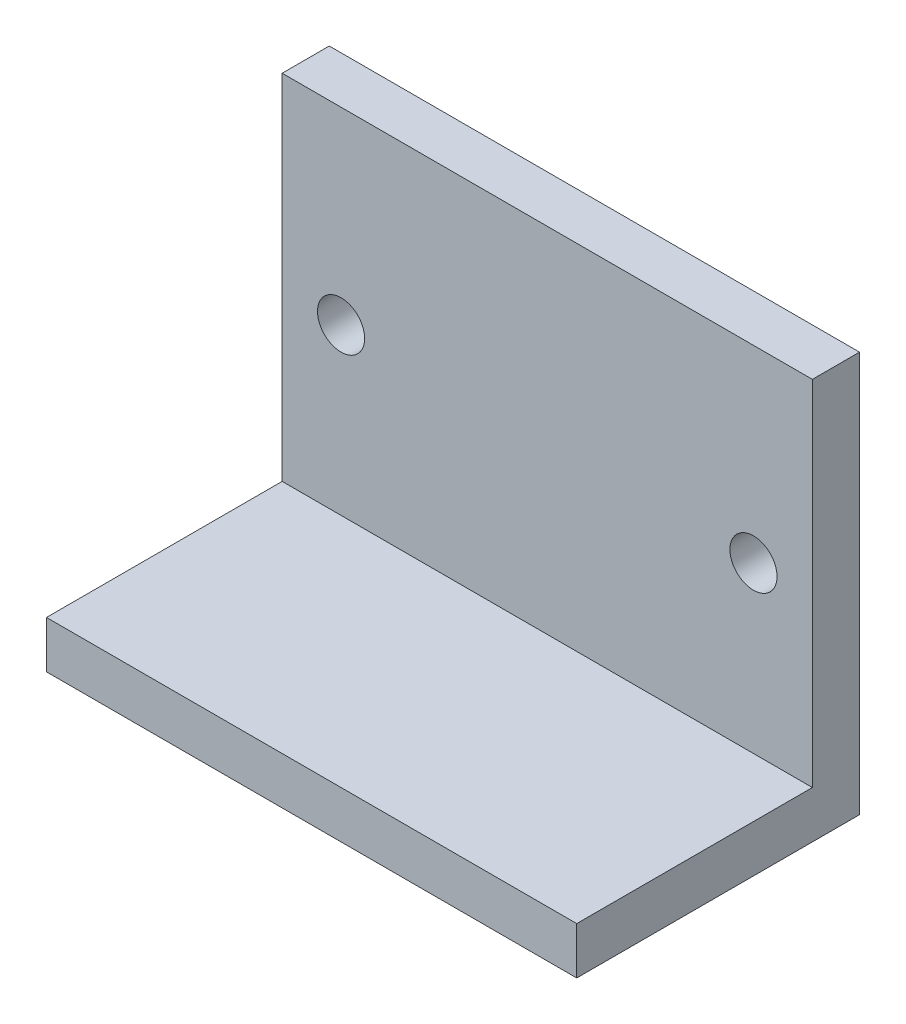
ISO-10303-21;
HEADER;
FILE_DESCRIPTION(('STEP AP214'),'2;1');
FILE_NAME('part.step','',(''),(''),'','','');
FILE_SCHEMA(('AUTOMOTIVE_DESIGN { 1 0 10303 214 1 1 1 1 }'));
ENDSEC;
DATA;
#1=APPLICATION_CONTEXT('core data for automotive mechanical design processes');
#2=APPLICATION_PROTOCOL_DEFINITION('international standard','automotive_design',2000,#1);
#3=PRODUCT_CONTEXT('',#1,'mechanical');
#4=PRODUCT('Part','Part','',(#3));
#5=PRODUCT_RELATED_PRODUCT_CATEGORY('part','',(#4));
#6=PRODUCT_DEFINITION_FORMATION('','',#4);
#7=PRODUCT_DEFINITION_CONTEXT('part definition',#1,'design');
#8=PRODUCT_DEFINITION('design','',#6,#7);
#9=PRODUCT_DEFINITION_SHAPE('','',#8);
#10=(LENGTH_UNIT() NAMED_UNIT(*) SI_UNIT(.MILLI.,.METRE.));
#11=(NAMED_UNIT(*) PLANE_ANGLE_UNIT() SI_UNIT($,.RADIAN.));
#12=(NAMED_UNIT(*) SI_UNIT($,.STERADIAN.) SOLID_ANGLE_UNIT());
#13=UNCERTAINTY_MEASURE_WITH_UNIT(LENGTH_MEASURE(1.E-05),#10,'distance_accuracy_value','');
#14=(GEOMETRIC_REPRESENTATION_CONTEXT(3) GLOBAL_UNCERTAINTY_ASSIGNED_CONTEXT((#13)) GLOBAL_UNIT_ASSIGNED_CONTEXT((#10,
#11,#12)) REPRESENTATION_CONTEXT('',''));
#15=CARTESIAN_POINT('',(0.,0.,0.));
#16=DIRECTION('',(0.,0.,1.));
#17=DIRECTION('',(1.,0.,0.));
#18=AXIS2_PLACEMENT_3D('',#15,#16,#17);
#19=CARTESIAN_POINT('',(0.,34.,4.));
#20=DIRECTION('',(1.,0.,0.));
#21=DIRECTION('',(0.,1.,0.));
#22=AXIS2_PLACEMENT_3D('',#19,#20,#21);
#23=PLANE('',#22);
#24=DIRECTION('',(0.,-1.,0.));
#25=VECTOR('',#24,1.);
#26=CARTESIAN_POINT('',(0.,34.,0.));
#27=LINE('',#26,#25);
#28=CARTESIAN_POINT('',(0.,34.,0.));
#29=VERTEX_POINT('',#28);
#30=CARTESIAN_POINT('',(0.,0.,0.));
#31=VERTEX_POINT('',#30);
#32=EDGE_CURVE('E97',#29,#31,#27,.T.);
#33=ORIENTED_EDGE('',*,*,#32,.T.);
#34=DIRECTION('',(0.,0.,-1.));
#35=VECTOR('',#34,1.);
#36=CARTESIAN_POINT('',(0.,0.,4.));
#37=LINE('',#36,#35);
#38=CARTESIAN_POINT('',(0.,0.,24.));
#39=VERTEX_POINT('',#38);
#40=EDGE_CURVE('E11',#39,#31,#37,.T.);
#41=ORIENTED_EDGE('',*,*,#40,.F.);
#42=DIRECTION('',(0.,-1.,0.));
#43=VECTOR('',#42,1.);
#44=CARTESIAN_POINT('',(0.,0.,24.));
#45=LINE('',#44,#43);
#46=CARTESIAN_POINT('',(0.,4.,24.));
#47=VERTEX_POINT('',#46);
#48=EDGE_CURVE('E139',#47,#39,#45,.T.);
#49=ORIENTED_EDGE('',*,*,#48,.F.);
#50=DIRECTION('',(0.,0.,-1.));
#51=VECTOR('',#50,1.);
#52=CARTESIAN_POINT('',(0.,4.,24.));
#53=LINE('',#52,#51);
#54=CARTESIAN_POINT('',(0.,4.,4.));
#55=VERTEX_POINT('',#54);
#56=EDGE_CURVE('E110',#47,#55,#53,.T.);
#57=ORIENTED_EDGE('',*,*,#56,.T.);
#58=DIRECTION('',(0.,-1.,0.));
#59=VECTOR('',#58,1.);
#60=CARTESIAN_POINT('',(0.,34.,4.));
#61=LINE('',#60,#59);
#62=CARTESIAN_POINT('',(0.,34.,4.));
#63=VERTEX_POINT('',#62);
#64=EDGE_CURVE('E91',#63,#55,#61,.T.);
#65=ORIENTED_EDGE('',*,*,#64,.F.);
#66=DIRECTION('',(0.,0.,-1.));
#67=VECTOR('',#66,1.);
#68=CARTESIAN_POINT('',(0.,34.,4.));
#69=LINE('',#68,#67);
#70=EDGE_CURVE('E83',#63,#29,#69,.T.);
#71=ORIENTED_EDGE('',*,*,#70,.T.);
#72=EDGE_LOOP('',(#33,#41,#49,#57,#65,#71));
#73=FACE_BOUND('',#72,.T.);
#74=ADVANCED_FACE('F38',(#73),#23,.F.);
#75=CARTESIAN_POINT('',(0.,0.,4.));
#76=DIRECTION('',(0.,1.,0.));
#77=DIRECTION('',(0.,0.,1.));
#78=AXIS2_PLACEMENT_3D('',#75,#76,#77);
#79=PLANE('',#78);
#80=DIRECTION('',(1.,0.,0.));
#81=VECTOR('',#80,1.);
#82=CARTESIAN_POINT('',(0.,0.,0.));
#83=LINE('',#82,#81);
#84=CARTESIAN_POINT('',(45.,0.,0.));
#85=VERTEX_POINT('',#84);
#86=EDGE_CURVE('E102',#31,#85,#83,.T.);
#87=ORIENTED_EDGE('',*,*,#86,.T.);
#88=DIRECTION('',(0.,0.,-1.));
#89=VECTOR('',#88,1.);
#90=CARTESIAN_POINT('',(45.,0.,4.));
#91=LINE('',#90,#89);
#92=CARTESIAN_POINT('',(45.,0.,24.));
#93=VERTEX_POINT('',#92);
#94=EDGE_CURVE('E47',#93,#85,#91,.T.);
#95=ORIENTED_EDGE('',*,*,#94,.F.);
#96=DIRECTION('',(1.,0.,0.));
#97=VECTOR('',#96,1.);
#98=CARTESIAN_POINT('',(0.,0.,24.));
#99=LINE('',#98,#97);
#100=EDGE_CURVE('E143',#39,#93,#99,.T.);
#101=ORIENTED_EDGE('',*,*,#100,.F.);
#102=ORIENTED_EDGE('',*,*,#40,.T.);
#103=EDGE_LOOP('',(#87,#95,#101,#102));
#104=FACE_BOUND('',#103,.T.);
#105=ADVANCED_FACE('F172',(#104),#79,.F.);
#106=CARTESIAN_POINT('',(45.,34.,4.));
#107=DIRECTION('',(-1.,0.,0.));
#108=DIRECTION('',(0.,-1.,0.));
#109=AXIS2_PLACEMENT_3D('',#106,#107,#108);
#110=PLANE('',#109);
#111=DIRECTION('',(0.,1.,0.));
#112=VECTOR('',#111,1.);
#113=CARTESIAN_POINT('',(45.,34.,0.));
#114=LINE('',#113,#112);
#115=CARTESIAN_POINT('',(45.,34.,0.));
#116=VERTEX_POINT('',#115);
#117=EDGE_CURVE('E92',#85,#116,#114,.T.);
#118=ORIENTED_EDGE('',*,*,#117,.T.);
#119=DIRECTION('',(0.,0.,-1.));
#120=VECTOR('',#119,1.);
#121=CARTESIAN_POINT('',(45.,34.,4.));
#122=LINE('',#121,#120);
#123=CARTESIAN_POINT('',(45.,34.,4.));
#124=VERTEX_POINT('',#123);
#125=EDGE_CURVE('E86',#124,#116,#122,.T.);
#126=ORIENTED_EDGE('',*,*,#125,.F.);
#127=DIRECTION('',(0.,1.,0.));
#128=VECTOR('',#127,1.);
#129=CARTESIAN_POINT('',(45.,34.,4.));
#130=LINE('',#129,#128);
#131=CARTESIAN_POINT('',(45.,4.,4.));
#132=VERTEX_POINT('',#131);
#133=EDGE_CURVE('E160',#132,#124,#130,.T.);
#134=ORIENTED_EDGE('',*,*,#133,.F.);
#135=DIRECTION('',(0.,0.,-1.));
#136=VECTOR('',#135,1.);
#137=CARTESIAN_POINT('',(45.,4.,24.));
#138=LINE('',#137,#136);
#139=CARTESIAN_POINT('',(45.,4.,24.));
#140=VERTEX_POINT('',#139);
#141=EDGE_CURVE('E104',#140,#132,#138,.T.);
#142=ORIENTED_EDGE('',*,*,#141,.F.);
#143=DIRECTION('',(0.,1.,0.));
#144=VECTOR('',#143,1.);
#145=CARTESIAN_POINT('',(45.,0.,24.));
#146=LINE('',#145,#144);
#147=EDGE_CURVE('E147',#93,#140,#146,.T.);
#148=ORIENTED_EDGE('',*,*,#147,.F.);
#149=ORIENTED_EDGE('',*,*,#94,.T.);
#150=EDGE_LOOP('',(#118,#126,#134,#142,#148,#149));
#151=FACE_BOUND('',#150,.T.);
#152=ADVANCED_FACE('F166',(#151),#110,.F.);
#153=CARTESIAN_POINT('',(0.,34.,4.));
#154=DIRECTION('',(0.,-1.,0.));
#155=DIRECTION('',(0.,0.,-1.));
#156=AXIS2_PLACEMENT_3D('',#153,#154,#155);
#157=PLANE('',#156);
#158=DIRECTION('',(-1.,0.,0.));
#159=VECTOR('',#158,1.);
#160=CARTESIAN_POINT('',(0.,34.,0.));
#161=LINE('',#160,#159);
#162=EDGE_CURVE('E80',#116,#29,#161,.T.);
#163=ORIENTED_EDGE('',*,*,#162,.T.);
#164=ORIENTED_EDGE('',*,*,#70,.F.);
#165=DIRECTION('',(-1.,0.,0.));
#166=VECTOR('',#165,1.);
#167=CARTESIAN_POINT('',(0.,34.,4.));
#168=LINE('',#167,#166);
#169=EDGE_CURVE('E61',#124,#63,#168,.T.);
#170=ORIENTED_EDGE('',*,*,#169,.F.);
#171=ORIENTED_EDGE('',*,*,#125,.T.);
#172=EDGE_LOOP('',(#163,#164,#170,#171));
#173=FACE_BOUND('',#172,.T.);
#174=ADVANCED_FACE('F82',(#173),#157,.F.);
#175=CARTESIAN_POINT('',(0.,0.,4.));
#176=DIRECTION('',(0.,0.,1.));
#177=DIRECTION('',(1.,0.,0.));
#178=AXIS2_PLACEMENT_3D('',#175,#176,#177);
#179=PLANE('',#178);
#180=CARTESIAN_POINT('',(4.99999999999998,18.,4.));
#181=DIRECTION('',(0.,0.,1.));
#182=DIRECTION('',(1.,0.,0.));
#183=AXIS2_PLACEMENT_3D('',#180,#181,#182);
#184=CIRCLE('',#183,2.);
#185=CARTESIAN_POINT('',(6.99999999999999,18.,4.));
#186=VERTEX_POINT('',#185);
#187=EDGE_CURVE('E124',#186,#186,#184,.T.);
#188=ORIENTED_EDGE('',*,*,#187,.F.);
#189=EDGE_LOOP('',(#188));
#190=FACE_BOUND('',#189,.T.);
#191=CARTESIAN_POINT('',(40.,18.,4.));
#192=DIRECTION('',(0.,0.,1.));
#193=DIRECTION('',(1.,0.,0.));
#194=AXIS2_PLACEMENT_3D('',#191,#192,#193);
#195=CIRCLE('',#194,2.);
#196=CARTESIAN_POINT('',(42.,18.,4.));
#197=VERTEX_POINT('',#196);
#198=EDGE_CURVE('E131',#197,#197,#195,.T.);
#199=ORIENTED_EDGE('',*,*,#198,.F.);
#200=EDGE_LOOP('',(#199));
#201=FACE_BOUND('',#200,.T.);
#202=DIRECTION('',(-1.,0.,0.));
#203=VECTOR('',#202,1.);
#204=CARTESIAN_POINT('',(0.,4.,4.));
#205=LINE('',#204,#203);
#206=EDGE_CURVE('E55',#132,#55,#205,.T.);
#207=ORIENTED_EDGE('',*,*,#206,.F.);
#208=ORIENTED_EDGE('',*,*,#133,.T.);
#209=ORIENTED_EDGE('',*,*,#169,.T.);
#210=ORIENTED_EDGE('',*,*,#64,.T.);
#211=EDGE_LOOP('',(#207,#208,#209,#210));
#212=FACE_BOUND('',#211,.T.);
#213=ADVANCED_FACE('F163',(#190,#201,#212),#179,.T.);
#214=CARTESIAN_POINT('',(0.,0.,0.));
#215=DIRECTION('',(0.,0.,1.));
#216=DIRECTION('',(1.,0.,0.));
#217=AXIS2_PLACEMENT_3D('',#214,#215,#216);
#218=PLANE('',#217);
#219=CARTESIAN_POINT('',(4.99999999999998,18.,0.));
#220=DIRECTION('',(0.,0.,1.));
#221=DIRECTION('',(1.,0.,0.));
#222=AXIS2_PLACEMENT_3D('',#219,#220,#221);
#223=CIRCLE('',#222,2.);
#224=CARTESIAN_POINT('',(6.99999999999999,18.,0.));
#225=VERTEX_POINT('',#224);
#226=EDGE_CURVE('E41',#225,#225,#223,.T.);
#227=ORIENTED_EDGE('',*,*,#226,.T.);
#228=EDGE_LOOP('',(#227));
#229=FACE_BOUND('',#228,.T.);
#230=CARTESIAN_POINT('',(40.,18.,0.));
#231=DIRECTION('',(0.,0.,1.));
#232=DIRECTION('',(1.,0.,0.));
#233=AXIS2_PLACEMENT_3D('',#230,#231,#232);
#234=CIRCLE('',#233,2.);
#235=CARTESIAN_POINT('',(42.,18.,0.));
#236=VERTEX_POINT('',#235);
#237=EDGE_CURVE('E121',#236,#236,#234,.T.);
#238=ORIENTED_EDGE('',*,*,#237,.T.);
#239=EDGE_LOOP('',(#238));
#240=FACE_BOUND('',#239,.T.);
#241=ORIENTED_EDGE('',*,*,#32,.F.);
#242=ORIENTED_EDGE('',*,*,#162,.F.);
#243=ORIENTED_EDGE('',*,*,#117,.F.);
#244=ORIENTED_EDGE('',*,*,#86,.F.);
#245=EDGE_LOOP('',(#241,#242,#243,#244));
#246=FACE_BOUND('',#245,.T.);
#247=ADVANCED_FACE('F101',(#229,#240,#246),#218,.F.);
#248=CARTESIAN_POINT('',(0.,4.,24.));
#249=DIRECTION('',(0.,-1.,0.));
#250=DIRECTION('',(0.,0.,-1.));
#251=AXIS2_PLACEMENT_3D('',#248,#249,#250);
#252=PLANE('',#251);
#253=ORIENTED_EDGE('',*,*,#206,.T.);
#254=ORIENTED_EDGE('',*,*,#56,.F.);
#255=DIRECTION('',(-1.,0.,0.));
#256=VECTOR('',#255,1.);
#257=CARTESIAN_POINT('',(0.,4.,24.));
#258=LINE('',#257,#256);
#259=EDGE_CURVE('E151',#140,#47,#258,.T.);
#260=ORIENTED_EDGE('',*,*,#259,.F.);
#261=ORIENTED_EDGE('',*,*,#141,.T.);
#262=EDGE_LOOP('',(#253,#254,#260,#261));
#263=FACE_BOUND('',#262,.T.);
#264=ADVANCED_FACE('F186',(#263),#252,.F.);
#265=CARTESIAN_POINT('',(0.,0.,24.));
#266=DIRECTION('',(0.,0.,-1.));
#267=DIRECTION('',(-1.,0.,0.));
#268=AXIS2_PLACEMENT_3D('',#265,#266,#267);
#269=PLANE('',#268);
#270=ORIENTED_EDGE('',*,*,#48,.T.);
#271=ORIENTED_EDGE('',*,*,#100,.T.);
#272=ORIENTED_EDGE('',*,*,#147,.T.);
#273=ORIENTED_EDGE('',*,*,#259,.T.);
#274=EDGE_LOOP('',(#270,#271,#272,#273));
#275=FACE_BOUND('',#274,.T.);
#276=ADVANCED_FACE('F177',(#275),#269,.F.);
#277=CARTESIAN_POINT('',(40.,18.,-6.));
#278=DIRECTION('',(0.,0.,1.));
#279=DIRECTION('',(1.,0.,0.));
#280=AXIS2_PLACEMENT_3D('',#277,#278,#279);
#281=CYLINDRICAL_SURFACE('',#280,2.);
#282=ORIENTED_EDGE('',*,*,#198,.T.);
#283=EDGE_LOOP('',(#282));
#284=FACE_BOUND('',#283,.T.);
#285=ORIENTED_EDGE('',*,*,#237,.F.);
#286=EDGE_LOOP('',(#285));
#287=FACE_BOUND('',#286,.T.);
#288=ADVANCED_FACE('F193',(#284,#287),#281,.F.);
#289=CARTESIAN_POINT('',(4.99999999999998,18.,-6.));
#290=DIRECTION('',(0.,0.,1.));
#291=DIRECTION('',(1.,0.,0.));
#292=AXIS2_PLACEMENT_3D('',#289,#290,#291);
#293=CYLINDRICAL_SURFACE('',#292,2.);
#294=ORIENTED_EDGE('',*,*,#187,.T.);
#295=EDGE_LOOP('',(#294));
#296=FACE_BOUND('',#295,.T.);
#297=ORIENTED_EDGE('',*,*,#226,.F.);
#298=EDGE_LOOP('',(#297));
#299=FACE_BOUND('',#298,.T.);
#300=ADVANCED_FACE('F217',(#296,#299),#293,.F.);
#301=CLOSED_SHELL('',(#74,#105,#152,#174,#213,#247,#264,#276,#288,#300));
#302=MANIFOLD_SOLID_BREP('B2',#301);
#303=ADVANCED_BREP_SHAPE_REPRESENTATION('',(#18,#302),#14);
#304=SHAPE_DEFINITION_REPRESENTATION(#9,#303);
ENDSEC;
END-ISO-10303-21;
